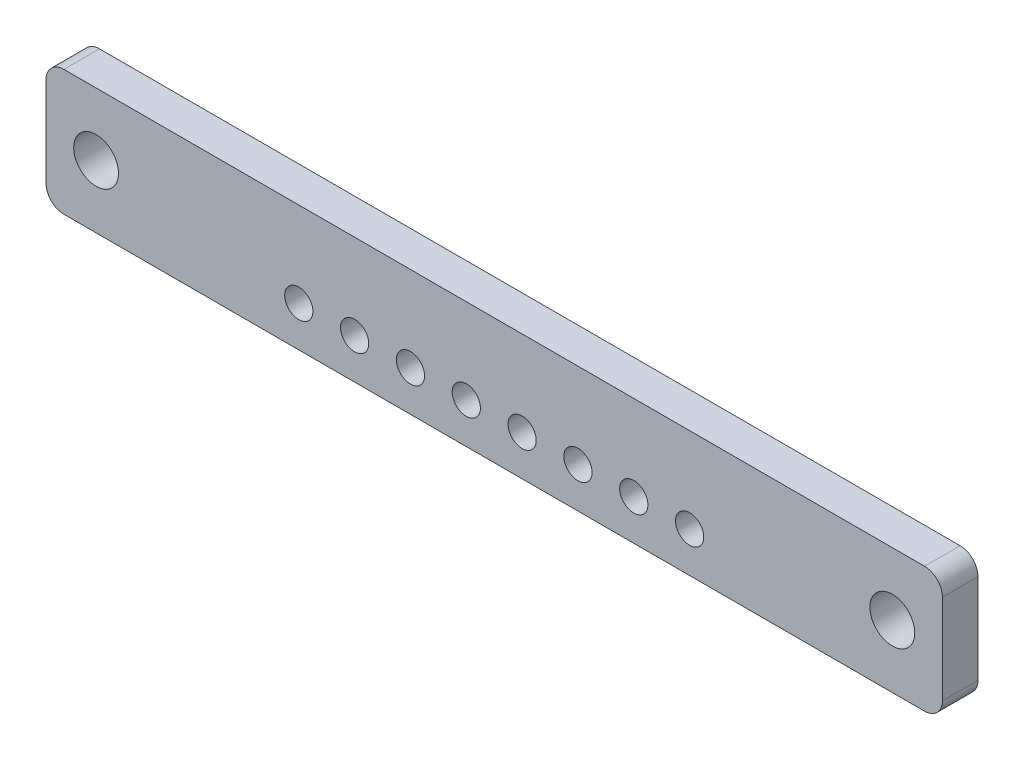
ISO-10303-21;
HEADER;
FILE_DESCRIPTION(('STEP AP214'),'2;1');
FILE_NAME('part.step','',(''),(''),'','','');
FILE_SCHEMA(('AUTOMOTIVE_DESIGN { 1 0 10303 214 1 1 1 1 }'));
ENDSEC;
DATA;
#1=APPLICATION_CONTEXT('core data for automotive mechanical design processes');
#2=APPLICATION_PROTOCOL_DEFINITION('international standard','automotive_design',2000,#1);
#3=PRODUCT_CONTEXT('',#1,'mechanical');
#4=PRODUCT('Part','Part','',(#3));
#5=PRODUCT_RELATED_PRODUCT_CATEGORY('part','',(#4));
#6=PRODUCT_DEFINITION_FORMATION('','',#4);
#7=PRODUCT_DEFINITION_CONTEXT('part definition',#1,'design');
#8=PRODUCT_DEFINITION('design','',#6,#7);
#9=PRODUCT_DEFINITION_SHAPE('','',#8);
#10=(LENGTH_UNIT() NAMED_UNIT(*) SI_UNIT(.MILLI.,.METRE.));
#11=(NAMED_UNIT(*) PLANE_ANGLE_UNIT() SI_UNIT($,.RADIAN.));
#12=(NAMED_UNIT(*) SI_UNIT($,.STERADIAN.) SOLID_ANGLE_UNIT());
#13=UNCERTAINTY_MEASURE_WITH_UNIT(LENGTH_MEASURE(1.E-05),#10,'distance_accuracy_value','');
#14=(GEOMETRIC_REPRESENTATION_CONTEXT(3) GLOBAL_UNCERTAINTY_ASSIGNED_CONTEXT((#13)) GLOBAL_UNIT_ASSIGNED_CONTEXT((#10,
#11,#12)) REPRESENTATION_CONTEXT('',''));
#15=CARTESIAN_POINT('',(0.,0.,0.));
#16=DIRECTION('',(0.,0.,1.));
#17=DIRECTION('',(1.,0.,0.));
#18=AXIS2_PLACEMENT_3D('',#15,#16,#17);
#19=CARTESIAN_POINT('',(0.,-23.495,21.7812));
#20=DIRECTION('',(0.,1.,0.));
#21=DIRECTION('',(0.,0.,1.));
#22=AXIS2_PLACEMENT_3D('',#19,#20,#21);
#23=PLANE('',#22);
#24=DIRECTION('',(-1.,0.,0.));
#25=VECTOR('',#24,1.);
#26=CARTESIAN_POINT('',(0.,-23.495,24.3012));
#27=LINE('',#26,#25);
#28=CARTESIAN_POINT('',(30.48,-23.495,24.3012));
#29=VERTEX_POINT('',#28);
#30=CARTESIAN_POINT('',(-30.48,-23.495,24.3012));
#31=VERTEX_POINT('',#30);
#32=EDGE_CURVE('E11',#29,#31,#27,.T.);
#33=ORIENTED_EDGE('',*,*,#32,.T.);
#34=DIRECTION('',(0.,0.,1.));
#35=VECTOR('',#34,1.);
#36=CARTESIAN_POINT('',(-30.48,-23.495,21.7812));
#37=LINE('',#36,#35);
#38=CARTESIAN_POINT('',(-30.48,-23.495,21.7812));
#39=VERTEX_POINT('',#38);
#40=EDGE_CURVE('E52',#39,#31,#37,.T.);
#41=ORIENTED_EDGE('',*,*,#40,.F.);
#42=DIRECTION('',(-1.,0.,0.));
#43=VECTOR('',#42,1.);
#44=CARTESIAN_POINT('',(0.,-23.495,21.7812));
#45=LINE('',#44,#43);
#46=CARTESIAN_POINT('',(30.48,-23.495,21.7812));
#47=VERTEX_POINT('',#46);
#48=EDGE_CURVE('E179',#47,#39,#45,.T.);
#49=ORIENTED_EDGE('',*,*,#48,.F.);
#50=DIRECTION('',(0.,0.,1.));
#51=VECTOR('',#50,1.);
#52=CARTESIAN_POINT('',(30.48,-23.495,21.7812));
#53=LINE('',#52,#51);
#54=EDGE_CURVE('E121',#47,#29,#53,.T.);
#55=ORIENTED_EDGE('',*,*,#54,.T.);
#56=EDGE_LOOP('',(#33,#41,#49,#55));
#57=FACE_BOUND('',#56,.T.);
#58=ADVANCED_FACE('F45',(#57),#23,.F.);
#59=CARTESIAN_POINT('',(-30.48,-22.225,21.7812));
#60=DIRECTION('',(0.,0.,1.));
#61=DIRECTION('',(1.,0.,0.));
#62=AXIS2_PLACEMENT_3D('',#59,#60,#61);
#63=CYLINDRICAL_SURFACE('',#62,1.27);
#64=CARTESIAN_POINT('',(-30.48,-22.225,24.3012));
#65=DIRECTION('',(0.,0.,-1.));
#66=DIRECTION('',(-1.,0.,0.));
#67=AXIS2_PLACEMENT_3D('',#64,#65,#66);
#68=CIRCLE('',#67,1.27);
#69=CARTESIAN_POINT('',(-31.75,-22.225,24.3012));
#70=VERTEX_POINT('',#69);
#71=EDGE_CURVE('E176',#31,#70,#68,.T.);
#72=ORIENTED_EDGE('',*,*,#71,.T.);
#73=DIRECTION('',(0.,0.,1.));
#74=VECTOR('',#73,1.);
#75=CARTESIAN_POINT('',(-31.75,-22.225,21.7812));
#76=LINE('',#75,#74);
#77=CARTESIAN_POINT('',(-31.75,-22.225,21.7812));
#78=VERTEX_POINT('',#77);
#79=EDGE_CURVE('E173',#78,#70,#76,.T.);
#80=ORIENTED_EDGE('',*,*,#79,.F.);
#81=CARTESIAN_POINT('',(-30.48,-22.225,21.7812));
#82=DIRECTION('',(0.,0.,-1.));
#83=DIRECTION('',(-1.,0.,0.));
#84=AXIS2_PLACEMENT_3D('',#81,#82,#83);
#85=CIRCLE('',#84,1.27);
#86=EDGE_CURVE('E170',#39,#78,#85,.T.);
#87=ORIENTED_EDGE('',*,*,#86,.F.);
#88=ORIENTED_EDGE('',*,*,#40,.T.);
#89=EDGE_LOOP('',(#72,#80,#87,#88));
#90=FACE_BOUND('',#89,.T.);
#91=ADVANCED_FACE('F182',(#90),#63,.T.);
#92=CARTESIAN_POINT('',(-31.75,-19.05,21.7812));
#93=DIRECTION('',(1.,0.,0.));
#94=DIRECTION('',(0.,0.,-1.));
#95=AXIS2_PLACEMENT_3D('',#92,#93,#94);
#96=PLANE('',#95);
#97=DIRECTION('',(0.,1.,0.));
#98=VECTOR('',#97,1.);
#99=CARTESIAN_POINT('',(-31.75,-19.05,24.3012));
#100=LINE('',#99,#98);
#101=CARTESIAN_POINT('',(-31.75,-15.875,24.3012));
#102=VERTEX_POINT('',#101);
#103=EDGE_CURVE('E168',#70,#102,#100,.T.);
#104=ORIENTED_EDGE('',*,*,#103,.T.);
#105=DIRECTION('',(0.,0.,1.));
#106=VECTOR('',#105,1.);
#107=CARTESIAN_POINT('',(-31.75,-15.875,21.7812));
#108=LINE('',#107,#106);
#109=CARTESIAN_POINT('',(-31.75,-15.875,21.7812));
#110=VERTEX_POINT('',#109);
#111=EDGE_CURVE('E165',#110,#102,#108,.T.);
#112=ORIENTED_EDGE('',*,*,#111,.F.);
#113=DIRECTION('',(0.,1.,0.));
#114=VECTOR('',#113,1.);
#115=CARTESIAN_POINT('',(-31.75,-19.05,21.7812));
#116=LINE('',#115,#114);
#117=EDGE_CURVE('E162',#78,#110,#116,.T.);
#118=ORIENTED_EDGE('',*,*,#117,.F.);
#119=ORIENTED_EDGE('',*,*,#79,.T.);
#120=EDGE_LOOP('',(#104,#112,#118,#119));
#121=FACE_BOUND('',#120,.T.);
#122=ADVANCED_FACE('F189',(#121),#96,.F.);
#123=CARTESIAN_POINT('',(-30.48,-15.875,21.7812));
#124=DIRECTION('',(0.,0.,1.));
#125=DIRECTION('',(1.,0.,0.));
#126=AXIS2_PLACEMENT_3D('',#123,#124,#125);
#127=CYLINDRICAL_SURFACE('',#126,1.27);
#128=CARTESIAN_POINT('',(-30.48,-15.875,24.3012));
#129=DIRECTION('',(0.,0.,1.));
#130=DIRECTION('',(1.,0.,0.));
#131=AXIS2_PLACEMENT_3D('',#128,#129,#130);
#132=CIRCLE('',#131,1.27);
#133=CARTESIAN_POINT('',(-30.48,-14.605,24.3012));
#134=VERTEX_POINT('',#133);
#135=EDGE_CURVE('E160',#102,#134,#132,.F.);
#136=ORIENTED_EDGE('',*,*,#135,.T.);
#137=DIRECTION('',(0.,0.,1.));
#138=VECTOR('',#137,1.);
#139=CARTESIAN_POINT('',(-30.48,-14.605,21.7812));
#140=LINE('',#139,#138);
#141=CARTESIAN_POINT('',(-30.48,-14.605,21.7812));
#142=VERTEX_POINT('',#141);
#143=EDGE_CURVE('E157',#142,#134,#140,.T.);
#144=ORIENTED_EDGE('',*,*,#143,.F.);
#145=CARTESIAN_POINT('',(-30.48,-15.875,21.7812));
#146=DIRECTION('',(0.,0.,1.));
#147=DIRECTION('',(1.,0.,0.));
#148=AXIS2_PLACEMENT_3D('',#145,#146,#147);
#149=CIRCLE('',#148,1.27);
#150=EDGE_CURVE('E154',#110,#142,#149,.F.);
#151=ORIENTED_EDGE('',*,*,#150,.F.);
#152=ORIENTED_EDGE('',*,*,#111,.T.);
#153=EDGE_LOOP('',(#136,#144,#151,#152));
#154=FACE_BOUND('',#153,.T.);
#155=ADVANCED_FACE('F193',(#154),#127,.T.);
#156=CARTESIAN_POINT('',(0.,-14.605,21.7812));
#157=DIRECTION('',(0.,1.,0.));
#158=DIRECTION('',(0.,0.,1.));
#159=AXIS2_PLACEMENT_3D('',#156,#157,#158);
#160=PLANE('',#159);
#161=DIRECTION('',(-1.,0.,0.));
#162=VECTOR('',#161,1.);
#163=CARTESIAN_POINT('',(0.,-14.605,24.3012));
#164=LINE('',#163,#162);
#165=CARTESIAN_POINT('',(30.48,-14.605,24.3012));
#166=VERTEX_POINT('',#165);
#167=EDGE_CURVE('E151',#166,#134,#164,.T.);
#168=ORIENTED_EDGE('',*,*,#167,.F.);
#169=DIRECTION('',(0.,0.,1.));
#170=VECTOR('',#169,1.);
#171=CARTESIAN_POINT('',(30.48,-14.605,21.7812));
#172=LINE('',#171,#170);
#173=CARTESIAN_POINT('',(30.48,-14.605,21.7812));
#174=VERTEX_POINT('',#173);
#175=EDGE_CURVE('E148',#174,#166,#172,.T.);
#176=ORIENTED_EDGE('',*,*,#175,.F.);
#177=DIRECTION('',(-1.,0.,0.));
#178=VECTOR('',#177,1.);
#179=CARTESIAN_POINT('',(0.,-14.605,21.7812));
#180=LINE('',#179,#178);
#181=EDGE_CURVE('E145',#174,#142,#180,.T.);
#182=ORIENTED_EDGE('',*,*,#181,.T.);
#183=ORIENTED_EDGE('',*,*,#143,.T.);
#184=EDGE_LOOP('',(#168,#176,#182,#183));
#185=FACE_BOUND('',#184,.T.);
#186=ADVANCED_FACE('F274',(#185),#160,.T.);
#187=CARTESIAN_POINT('',(30.48,-15.875,21.7812));
#188=DIRECTION('',(0.,0.,1.));
#189=DIRECTION('',(1.,0.,0.));
#190=AXIS2_PLACEMENT_3D('',#187,#188,#189);
#191=CYLINDRICAL_SURFACE('',#190,1.27);
#192=CARTESIAN_POINT('',(30.48,-15.875,24.3012));
#193=DIRECTION('',(0.,0.,1.));
#194=DIRECTION('',(1.,0.,0.));
#195=AXIS2_PLACEMENT_3D('',#192,#193,#194);
#196=CIRCLE('',#195,1.27);
#197=CARTESIAN_POINT('',(31.75,-15.875,24.3012));
#198=VERTEX_POINT('',#197);
#199=EDGE_CURVE('E143',#166,#198,#196,.F.);
#200=ORIENTED_EDGE('',*,*,#199,.T.);
#201=DIRECTION('',(0.,0.,1.));
#202=VECTOR('',#201,1.);
#203=CARTESIAN_POINT('',(31.75,-15.875,21.7812));
#204=LINE('',#203,#202);
#205=CARTESIAN_POINT('',(31.75,-15.875,21.7812));
#206=VERTEX_POINT('',#205);
#207=EDGE_CURVE('E141',#206,#198,#204,.T.);
#208=ORIENTED_EDGE('',*,*,#207,.F.);
#209=CARTESIAN_POINT('',(30.48,-15.875,21.7812));
#210=DIRECTION('',(0.,0.,1.));
#211=DIRECTION('',(1.,0.,0.));
#212=AXIS2_PLACEMENT_3D('',#209,#210,#211);
#213=CIRCLE('',#212,1.27);
#214=EDGE_CURVE('E131',#174,#206,#213,.F.);
#215=ORIENTED_EDGE('',*,*,#214,.F.);
#216=ORIENTED_EDGE('',*,*,#175,.T.);
#217=EDGE_LOOP('',(#200,#208,#215,#216));
#218=FACE_BOUND('',#217,.T.);
#219=ADVANCED_FACE('F261',(#218),#191,.T.);
#220=CARTESIAN_POINT('',(31.75,-19.05,21.7812));
#221=DIRECTION('',(1.,0.,0.));
#222=DIRECTION('',(0.,0.,-1.));
#223=AXIS2_PLACEMENT_3D('',#220,#221,#222);
#224=PLANE('',#223);
#225=DIRECTION('',(0.,1.,0.));
#226=VECTOR('',#225,1.);
#227=CARTESIAN_POINT('',(31.75,-19.05,24.3012));
#228=LINE('',#227,#226);
#229=CARTESIAN_POINT('',(31.75,-22.225,24.3012));
#230=VERTEX_POINT('',#229);
#231=EDGE_CURVE('E112',#230,#198,#228,.T.);
#232=ORIENTED_EDGE('',*,*,#231,.F.);
#233=DIRECTION('',(0.,0.,1.));
#234=VECTOR('',#233,1.);
#235=CARTESIAN_POINT('',(31.75,-22.225,21.7812));
#236=LINE('',#235,#234);
#237=CARTESIAN_POINT('',(31.75,-22.225,21.7812));
#238=VERTEX_POINT('',#237);
#239=EDGE_CURVE('E104',#238,#230,#236,.T.);
#240=ORIENTED_EDGE('',*,*,#239,.F.);
#241=DIRECTION('',(0.,1.,0.));
#242=VECTOR('',#241,1.);
#243=CARTESIAN_POINT('',(31.75,-19.05,21.7812));
#244=LINE('',#243,#242);
#245=EDGE_CURVE('E109',#238,#206,#244,.T.);
#246=ORIENTED_EDGE('',*,*,#245,.T.);
#247=ORIENTED_EDGE('',*,*,#207,.T.);
#248=EDGE_LOOP('',(#232,#240,#246,#247));
#249=FACE_BOUND('',#248,.T.);
#250=ADVANCED_FACE('F106',(#249),#224,.T.);
#251=CARTESIAN_POINT('',(9.88785714285713,-20.6375,21.7812));
#252=DIRECTION('',(0.,0.,1.));
#253=DIRECTION('',(1.,0.,0.));
#254=AXIS2_PLACEMENT_3D('',#251,#252,#253);
#255=CYLINDRICAL_SURFACE('',#254,1.);
#256=CARTESIAN_POINT('',(9.88785714285713,-20.6375,21.7812));
#257=DIRECTION('',(0.,0.,-1.));
#258=DIRECTION('',(-1.,0.,0.));
#259=AXIS2_PLACEMENT_3D('',#256,#257,#258);
#260=CIRCLE('',#259,1.);
#261=CARTESIAN_POINT('',(8.88785714285713,-20.6375,21.7812));
#262=VERTEX_POINT('',#261);
#263=EDGE_CURVE('E132',#262,#262,#260,.T.);
#264=ORIENTED_EDGE('',*,*,#263,.T.);
#265=EDGE_LOOP('',(#264));
#266=FACE_BOUND('',#265,.T.);
#267=CARTESIAN_POINT('',(9.88785714285713,-20.6375,24.3012));
#268=DIRECTION('',(0.,0.,-1.));
#269=DIRECTION('',(-1.,0.,0.));
#270=AXIS2_PLACEMENT_3D('',#267,#268,#269);
#271=CIRCLE('',#270,1.);
#272=CARTESIAN_POINT('',(8.88785714285713,-20.6375,24.3012));
#273=VERTEX_POINT('',#272);
#274=EDGE_CURVE('E135',#273,#273,#271,.T.);
#275=ORIENTED_EDGE('',*,*,#274,.F.);
#276=EDGE_LOOP('',(#275));
#277=FACE_BOUND('',#276,.T.);
#278=ADVANCED_FACE('F249',(#266,#277),#255,.F.);
#279=CARTESIAN_POINT('',(5.93271428571428,-20.6375,21.7812));
#280=DIRECTION('',(0.,0.,1.));
#281=DIRECTION('',(1.,0.,0.));
#282=AXIS2_PLACEMENT_3D('',#279,#280,#281);
#283=CYLINDRICAL_SURFACE('',#282,1.);
#284=CARTESIAN_POINT('',(5.93271428571428,-20.6375,21.7812));
#285=DIRECTION('',(0.,0.,-1.));
#286=DIRECTION('',(-1.,0.,0.));
#287=AXIS2_PLACEMENT_3D('',#284,#285,#286);
#288=CIRCLE('',#287,1.);
#289=CARTESIAN_POINT('',(4.93271428571428,-20.6375,21.7812));
#290=VERTEX_POINT('',#289);
#291=EDGE_CURVE('E242',#290,#290,#288,.T.);
#292=ORIENTED_EDGE('',*,*,#291,.T.);
#293=EDGE_LOOP('',(#292));
#294=FACE_BOUND('',#293,.T.);
#295=CARTESIAN_POINT('',(5.93271428571428,-20.6375,24.3012));
#296=DIRECTION('',(0.,0.,-1.));
#297=DIRECTION('',(-1.,0.,0.));
#298=AXIS2_PLACEMENT_3D('',#295,#296,#297);
#299=CIRCLE('',#298,1.);
#300=CARTESIAN_POINT('',(4.93271428571428,-20.6375,24.3012));
#301=VERTEX_POINT('',#300);
#302=EDGE_CURVE('E239',#301,#301,#299,.T.);
#303=ORIENTED_EDGE('',*,*,#302,.F.);
#304=EDGE_LOOP('',(#303));
#305=FACE_BOUND('',#304,.T.);
#306=ADVANCED_FACE('F251',(#294,#305),#283,.F.);
#307=CARTESIAN_POINT('',(1.97757142857142,-20.6375,21.7812));
#308=DIRECTION('',(0.,0.,1.));
#309=DIRECTION('',(1.,0.,0.));
#310=AXIS2_PLACEMENT_3D('',#307,#308,#309);
#311=CYLINDRICAL_SURFACE('',#310,1.);
#312=CARTESIAN_POINT('',(1.97757142857142,-20.6375,21.7812));
#313=DIRECTION('',(0.,0.,-1.));
#314=DIRECTION('',(-1.,0.,0.));
#315=AXIS2_PLACEMENT_3D('',#312,#313,#314);
#316=CIRCLE('',#315,1.);
#317=CARTESIAN_POINT('',(0.97757142857142,-20.6375,21.7812));
#318=VERTEX_POINT('',#317);
#319=EDGE_CURVE('E236',#318,#318,#316,.T.);
#320=ORIENTED_EDGE('',*,*,#319,.T.);
#321=EDGE_LOOP('',(#320));
#322=FACE_BOUND('',#321,.T.);
#323=CARTESIAN_POINT('',(1.97757142857142,-20.6375,24.3012));
#324=DIRECTION('',(0.,0.,-1.));
#325=DIRECTION('',(-1.,0.,0.));
#326=AXIS2_PLACEMENT_3D('',#323,#324,#325);
#327=CIRCLE('',#326,1.);
#328=CARTESIAN_POINT('',(0.97757142857142,-20.6375,24.3012));
#329=VERTEX_POINT('',#328);
#330=EDGE_CURVE('E233',#329,#329,#327,.T.);
#331=ORIENTED_EDGE('',*,*,#330,.F.);
#332=EDGE_LOOP('',(#331));
#333=FACE_BOUND('',#332,.T.);
#334=ADVANCED_FACE('F258',(#322,#333),#311,.F.);
#335=CARTESIAN_POINT('',(-1.97757142857143,-20.6375,21.7812));
#336=DIRECTION('',(0.,0.,1.));
#337=DIRECTION('',(1.,0.,0.));
#338=AXIS2_PLACEMENT_3D('',#335,#336,#337);
#339=CYLINDRICAL_SURFACE('',#338,1.);
#340=CARTESIAN_POINT('',(-1.97757142857143,-20.6375,21.7812));
#341=DIRECTION('',(0.,0.,-1.));
#342=DIRECTION('',(-1.,0.,0.));
#343=AXIS2_PLACEMENT_3D('',#340,#341,#342);
#344=CIRCLE('',#343,1.);
#345=CARTESIAN_POINT('',(-2.97757142857143,-20.6375,21.7812));
#346=VERTEX_POINT('',#345);
#347=EDGE_CURVE('E230',#346,#346,#344,.T.);
#348=ORIENTED_EDGE('',*,*,#347,.T.);
#349=EDGE_LOOP('',(#348));
#350=FACE_BOUND('',#349,.T.);
#351=CARTESIAN_POINT('',(-1.97757142857143,-20.6375,24.3012));
#352=DIRECTION('',(0.,0.,-1.));
#353=DIRECTION('',(-1.,0.,0.));
#354=AXIS2_PLACEMENT_3D('',#351,#352,#353);
#355=CIRCLE('',#354,1.);
#356=CARTESIAN_POINT('',(-2.97757142857143,-20.6375,24.3012));
#357=VERTEX_POINT('',#356);
#358=EDGE_CURVE('E227',#357,#357,#355,.T.);
#359=ORIENTED_EDGE('',*,*,#358,.F.);
#360=EDGE_LOOP('',(#359));
#361=FACE_BOUND('',#360,.T.);
#362=ADVANCED_FACE('F313',(#350,#361),#339,.F.);
#363=CARTESIAN_POINT('',(-5.9327142857143,-20.6375,21.7812));
#364=DIRECTION('',(0.,0.,1.));
#365=DIRECTION('',(1.,0.,0.));
#366=AXIS2_PLACEMENT_3D('',#363,#364,#365);
#367=CYLINDRICAL_SURFACE('',#366,1.);
#368=CARTESIAN_POINT('',(-5.9327142857143,-20.6375,21.7812));
#369=DIRECTION('',(0.,0.,-1.));
#370=DIRECTION('',(-1.,0.,0.));
#371=AXIS2_PLACEMENT_3D('',#368,#369,#370);
#372=CIRCLE('',#371,1.);
#373=CARTESIAN_POINT('',(-6.9327142857143,-20.6375,21.7812));
#374=VERTEX_POINT('',#373);
#375=EDGE_CURVE('E224',#374,#374,#372,.T.);
#376=ORIENTED_EDGE('',*,*,#375,.T.);
#377=EDGE_LOOP('',(#376));
#378=FACE_BOUND('',#377,.T.);
#379=CARTESIAN_POINT('',(-5.9327142857143,-20.6375,24.3012));
#380=DIRECTION('',(0.,0.,-1.));
#381=DIRECTION('',(-1.,0.,0.));
#382=AXIS2_PLACEMENT_3D('',#379,#380,#381);
#383=CIRCLE('',#382,1.);
#384=CARTESIAN_POINT('',(-6.9327142857143,-20.6375,24.3012));
#385=VERTEX_POINT('',#384);
#386=EDGE_CURVE('E221',#385,#385,#383,.T.);
#387=ORIENTED_EDGE('',*,*,#386,.F.);
#388=EDGE_LOOP('',(#387));
#389=FACE_BOUND('',#388,.T.);
#390=ADVANCED_FACE('F324',(#378,#389),#367,.F.);
#391=CARTESIAN_POINT('',(-9.88785714285715,-20.6375,21.7812));
#392=DIRECTION('',(0.,0.,1.));
#393=DIRECTION('',(1.,0.,0.));
#394=AXIS2_PLACEMENT_3D('',#391,#392,#393);
#395=CYLINDRICAL_SURFACE('',#394,1.);
#396=CARTESIAN_POINT('',(-9.88785714285715,-20.6375,21.7812));
#397=DIRECTION('',(0.,0.,-1.));
#398=DIRECTION('',(-1.,0.,0.));
#399=AXIS2_PLACEMENT_3D('',#396,#397,#398);
#400=CIRCLE('',#399,1.);
#401=CARTESIAN_POINT('',(-10.8878571428572,-20.6375,21.7812));
#402=VERTEX_POINT('',#401);
#403=EDGE_CURVE('E218',#402,#402,#400,.T.);
#404=ORIENTED_EDGE('',*,*,#403,.T.);
#405=EDGE_LOOP('',(#404));
#406=FACE_BOUND('',#405,.T.);
#407=CARTESIAN_POINT('',(-9.88785714285715,-20.6375,24.3012));
#408=DIRECTION('',(0.,0.,-1.));
#409=DIRECTION('',(-1.,0.,0.));
#410=AXIS2_PLACEMENT_3D('',#407,#408,#409);
#411=CIRCLE('',#410,1.);
#412=CARTESIAN_POINT('',(-10.8878571428572,-20.6375,24.3012));
#413=VERTEX_POINT('',#412);
#414=EDGE_CURVE('E215',#413,#413,#411,.T.);
#415=ORIENTED_EDGE('',*,*,#414,.F.);
#416=EDGE_LOOP('',(#415));
#417=FACE_BOUND('',#416,.T.);
#418=ADVANCED_FACE('F335',(#406,#417),#395,.F.);
#419=CARTESIAN_POINT('',(-13.843,-20.6375,21.7812));
#420=DIRECTION('',(0.,0.,1.));
#421=DIRECTION('',(1.,0.,0.));
#422=AXIS2_PLACEMENT_3D('',#419,#420,#421);
#423=CYLINDRICAL_SURFACE('',#422,1.);
#424=CARTESIAN_POINT('',(-13.843,-20.6375,21.7812));
#425=DIRECTION('',(0.,0.,-1.));
#426=DIRECTION('',(-1.,0.,0.));
#427=AXIS2_PLACEMENT_3D('',#424,#425,#426);
#428=CIRCLE('',#427,1.);
#429=CARTESIAN_POINT('',(-14.843,-20.6375,21.7812));
#430=VERTEX_POINT('',#429);
#431=EDGE_CURVE('E212',#430,#430,#428,.T.);
#432=ORIENTED_EDGE('',*,*,#431,.T.);
#433=EDGE_LOOP('',(#432));
#434=FACE_BOUND('',#433,.T.);
#435=CARTESIAN_POINT('',(-13.843,-20.6375,24.3012));
#436=DIRECTION('',(0.,0.,-1.));
#437=DIRECTION('',(-1.,0.,0.));
#438=AXIS2_PLACEMENT_3D('',#435,#436,#437);
#439=CIRCLE('',#438,1.);
#440=CARTESIAN_POINT('',(-14.843,-20.6375,24.3012));
#441=VERTEX_POINT('',#440);
#442=EDGE_CURVE('E209',#441,#441,#439,.T.);
#443=ORIENTED_EDGE('',*,*,#442,.F.);
#444=EDGE_LOOP('',(#443));
#445=FACE_BOUND('',#444,.T.);
#446=ADVANCED_FACE('F346',(#434,#445),#423,.F.);
#447=CARTESIAN_POINT('',(-28.2004113120917,-19.05,21.7812));
#448=DIRECTION('',(0.,0.,1.));
#449=DIRECTION('',(1.,0.,0.));
#450=AXIS2_PLACEMENT_3D('',#447,#448,#449);
#451=CYLINDRICAL_SURFACE('',#450,1.5875);
#452=CARTESIAN_POINT('',(-28.2004113120917,-19.05,21.7812));
#453=DIRECTION('',(0.,0.,-1.));
#454=DIRECTION('',(-1.,0.,0.));
#455=AXIS2_PLACEMENT_3D('',#452,#453,#454);
#456=CIRCLE('',#455,1.5875);
#457=CARTESIAN_POINT('',(-29.7879113120917,-19.05,21.7812));
#458=VERTEX_POINT('',#457);
#459=EDGE_CURVE('E206',#458,#458,#456,.T.);
#460=ORIENTED_EDGE('',*,*,#459,.T.);
#461=EDGE_LOOP('',(#460));
#462=FACE_BOUND('',#461,.T.);
#463=CARTESIAN_POINT('',(-28.2004113120917,-19.05,24.3012));
#464=DIRECTION('',(0.,0.,-1.));
#465=DIRECTION('',(-1.,0.,0.));
#466=AXIS2_PLACEMENT_3D('',#463,#464,#465);
#467=CIRCLE('',#466,1.5875);
#468=CARTESIAN_POINT('',(-29.7879113120917,-19.05,24.3012));
#469=VERTEX_POINT('',#468);
#470=EDGE_CURVE('E203',#469,#469,#467,.T.);
#471=ORIENTED_EDGE('',*,*,#470,.F.);
#472=EDGE_LOOP('',(#471));
#473=FACE_BOUND('',#472,.T.);
#474=ADVANCED_FACE('F357',(#462,#473),#451,.F.);
#475=CARTESIAN_POINT('',(28.2004113120917,-19.05,21.7812));
#476=DIRECTION('',(0.,0.,1.));
#477=DIRECTION('',(1.,0.,0.));
#478=AXIS2_PLACEMENT_3D('',#475,#476,#477);
#479=CYLINDRICAL_SURFACE('',#478,1.5875);
#480=CARTESIAN_POINT('',(28.2004113120917,-19.05,21.7812));
#481=DIRECTION('',(0.,0.,1.));
#482=DIRECTION('',(-1.,0.,0.));
#483=AXIS2_PLACEMENT_3D('',#480,#481,#482);
#484=CIRCLE('',#483,1.5875);
#485=CARTESIAN_POINT('',(26.6129113120918,-19.05,21.7812));
#486=VERTEX_POINT('',#485);
#487=EDGE_CURVE('E197',#486,#486,#484,.T.);
#488=ORIENTED_EDGE('',*,*,#487,.F.);
#489=EDGE_LOOP('',(#488));
#490=FACE_BOUND('',#489,.T.);
#491=CARTESIAN_POINT('',(28.2004113120917,-19.05,24.3012));
#492=DIRECTION('',(0.,0.,1.));
#493=DIRECTION('',(-1.,0.,0.));
#494=AXIS2_PLACEMENT_3D('',#491,#492,#493);
#495=CIRCLE('',#494,1.5875);
#496=CARTESIAN_POINT('',(26.6129113120918,-19.05,24.3012));
#497=VERTEX_POINT('',#496);
#498=EDGE_CURVE('E194',#497,#497,#495,.T.);
#499=ORIENTED_EDGE('',*,*,#498,.T.);
#500=EDGE_LOOP('',(#499));
#501=FACE_BOUND('',#500,.T.);
#502=ADVANCED_FACE('F368',(#490,#501),#479,.F.);
#503=CARTESIAN_POINT('',(30.48,-22.225,21.7812));
#504=DIRECTION('',(0.,0.,1.));
#505=DIRECTION('',(1.,0.,0.));
#506=AXIS2_PLACEMENT_3D('',#503,#504,#505);
#507=CYLINDRICAL_SURFACE('',#506,1.27);
#508=CARTESIAN_POINT('',(30.48,-22.225,24.3012));
#509=DIRECTION('',(0.,0.,-1.));
#510=DIRECTION('',(-1.,0.,0.));
#511=AXIS2_PLACEMENT_3D('',#508,#509,#510);
#512=CIRCLE('',#511,1.27);
#513=EDGE_CURVE('E124',#230,#29,#512,.T.);
#514=ORIENTED_EDGE('',*,*,#513,.T.);
#515=ORIENTED_EDGE('',*,*,#54,.F.);
#516=CARTESIAN_POINT('',(30.48,-22.225,21.7812));
#517=DIRECTION('',(0.,0.,-1.));
#518=DIRECTION('',(-1.,0.,0.));
#519=AXIS2_PLACEMENT_3D('',#516,#517,#518);
#520=CIRCLE('',#519,1.27);
#521=EDGE_CURVE('E119',#238,#47,#520,.T.);
#522=ORIENTED_EDGE('',*,*,#521,.F.);
#523=ORIENTED_EDGE('',*,*,#239,.T.);
#524=EDGE_LOOP('',(#514,#515,#522,#523));
#525=FACE_BOUND('',#524,.T.);
#526=ADVANCED_FACE('F120',(#525),#507,.T.);
#527=CARTESIAN_POINT('',(13.843,-20.6375,21.7812));
#528=DIRECTION('',(0.,0.,1.));
#529=DIRECTION('',(1.,0.,0.));
#530=AXIS2_PLACEMENT_3D('',#527,#528,#529);
#531=CYLINDRICAL_SURFACE('',#530,1.);
#532=CARTESIAN_POINT('',(13.843,-20.6375,21.7812));
#533=DIRECTION('',(0.,0.,-1.));
#534=DIRECTION('',(-1.,0.,0.));
#535=AXIS2_PLACEMENT_3D('',#532,#533,#534);
#536=CIRCLE('',#535,1.);
#537=CARTESIAN_POINT('',(12.843,-20.6375,21.7812));
#538=VERTEX_POINT('',#537);
#539=EDGE_CURVE('E125',#538,#538,#536,.T.);
#540=ORIENTED_EDGE('',*,*,#539,.T.);
#541=EDGE_LOOP('',(#540));
#542=FACE_BOUND('',#541,.T.);
#543=CARTESIAN_POINT('',(13.843,-20.6375,24.3012));
#544=DIRECTION('',(0.,0.,-1.));
#545=DIRECTION('',(-1.,0.,0.));
#546=AXIS2_PLACEMENT_3D('',#543,#544,#545);
#547=CIRCLE('',#546,1.);
#548=CARTESIAN_POINT('',(12.843,-20.6375,24.3012));
#549=VERTEX_POINT('',#548);
#550=EDGE_CURVE('E477',#549,#549,#547,.T.);
#551=ORIENTED_EDGE('',*,*,#550,.F.);
#552=EDGE_LOOP('',(#551));
#553=FACE_BOUND('',#552,.T.);
#554=ADVANCED_FACE('F389',(#542,#553),#531,.F.);
#555=CARTESIAN_POINT('',(0.,-19.05,21.7812));
#556=DIRECTION('',(0.,0.,-1.));
#557=DIRECTION('',(1.,0.,0.));
#558=AXIS2_PLACEMENT_3D('',#555,#556,#557);
#559=PLANE('',#558);
#560=ORIENTED_EDGE('',*,*,#48,.T.);
#561=ORIENTED_EDGE('',*,*,#86,.T.);
#562=ORIENTED_EDGE('',*,*,#117,.T.);
#563=ORIENTED_EDGE('',*,*,#150,.T.);
#564=ORIENTED_EDGE('',*,*,#181,.F.);
#565=ORIENTED_EDGE('',*,*,#214,.T.);
#566=ORIENTED_EDGE('',*,*,#245,.F.);
#567=ORIENTED_EDGE('',*,*,#521,.T.);
#568=EDGE_LOOP('',(#560,#561,#562,#563,#564,#565,#566,#567));
#569=FACE_BOUND('',#568,.T.);
#570=ORIENTED_EDGE('',*,*,#487,.T.);
#571=EDGE_LOOP('',(#570));
#572=FACE_BOUND('',#571,.T.);
#573=ORIENTED_EDGE('',*,*,#459,.F.);
#574=EDGE_LOOP('',(#573));
#575=FACE_BOUND('',#574,.T.);
#576=ORIENTED_EDGE('',*,*,#431,.F.);
#577=EDGE_LOOP('',(#576));
#578=FACE_BOUND('',#577,.T.);
#579=ORIENTED_EDGE('',*,*,#403,.F.);
#580=EDGE_LOOP('',(#579));
#581=FACE_BOUND('',#580,.T.);
#582=ORIENTED_EDGE('',*,*,#375,.F.);
#583=EDGE_LOOP('',(#582));
#584=FACE_BOUND('',#583,.T.);
#585=ORIENTED_EDGE('',*,*,#347,.F.);
#586=EDGE_LOOP('',(#585));
#587=FACE_BOUND('',#586,.T.);
#588=ORIENTED_EDGE('',*,*,#319,.F.);
#589=EDGE_LOOP('',(#588));
#590=FACE_BOUND('',#589,.T.);
#591=ORIENTED_EDGE('',*,*,#291,.F.);
#592=EDGE_LOOP('',(#591));
#593=FACE_BOUND('',#592,.T.);
#594=ORIENTED_EDGE('',*,*,#263,.F.);
#595=EDGE_LOOP('',(#594));
#596=FACE_BOUND('',#595,.T.);
#597=ORIENTED_EDGE('',*,*,#539,.F.);
#598=EDGE_LOOP('',(#597));
#599=FACE_BOUND('',#598,.T.);
#600=ADVANCED_FACE('F127',(#569,#572,#575,#578,#581,#584,#587,#590,#593,#596,#599),#559,.T.);
#601=CARTESIAN_POINT('',(0.,-19.05,24.3012));
#602=DIRECTION('',(0.,0.,-1.));
#603=DIRECTION('',(1.,0.,0.));
#604=AXIS2_PLACEMENT_3D('',#601,#602,#603);
#605=PLANE('',#604);
#606=ORIENTED_EDGE('',*,*,#32,.F.);
#607=ORIENTED_EDGE('',*,*,#513,.F.);
#608=ORIENTED_EDGE('',*,*,#231,.T.);
#609=ORIENTED_EDGE('',*,*,#199,.F.);
#610=ORIENTED_EDGE('',*,*,#167,.T.);
#611=ORIENTED_EDGE('',*,*,#135,.F.);
#612=ORIENTED_EDGE('',*,*,#103,.F.);
#613=ORIENTED_EDGE('',*,*,#71,.F.);
#614=EDGE_LOOP('',(#606,#607,#608,#609,#610,#611,#612,#613));
#615=FACE_BOUND('',#614,.T.);
#616=ORIENTED_EDGE('',*,*,#498,.F.);
#617=EDGE_LOOP('',(#616));
#618=FACE_BOUND('',#617,.T.);
#619=ORIENTED_EDGE('',*,*,#470,.T.);
#620=EDGE_LOOP('',(#619));
#621=FACE_BOUND('',#620,.T.);
#622=ORIENTED_EDGE('',*,*,#442,.T.);
#623=EDGE_LOOP('',(#622));
#624=FACE_BOUND('',#623,.T.);
#625=ORIENTED_EDGE('',*,*,#414,.T.);
#626=EDGE_LOOP('',(#625));
#627=FACE_BOUND('',#626,.T.);
#628=ORIENTED_EDGE('',*,*,#386,.T.);
#629=EDGE_LOOP('',(#628));
#630=FACE_BOUND('',#629,.T.);
#631=ORIENTED_EDGE('',*,*,#358,.T.);
#632=EDGE_LOOP('',(#631));
#633=FACE_BOUND('',#632,.T.);
#634=ORIENTED_EDGE('',*,*,#330,.T.);
#635=EDGE_LOOP('',(#634));
#636=FACE_BOUND('',#635,.T.);
#637=ORIENTED_EDGE('',*,*,#302,.T.);
#638=EDGE_LOOP('',(#637));
#639=FACE_BOUND('',#638,.T.);
#640=ORIENTED_EDGE('',*,*,#274,.T.);
#641=EDGE_LOOP('',(#640));
#642=FACE_BOUND('',#641,.T.);
#643=ORIENTED_EDGE('',*,*,#550,.T.);
#644=EDGE_LOOP('',(#643));
#645=FACE_BOUND('',#644,.T.);
#646=ADVANCED_FACE('F185',(#615,#618,#621,#624,#627,#630,#633,#636,#639,#642,#645),#605,.F.);
#647=CLOSED_SHELL('',(#58,#91,#122,#155,#186,#219,#250,#278,#306,#334,#362,#390,#418,#446,#474,
#502,#526,#554,#600,#646));
#648=MANIFOLD_SOLID_BREP('B2',#647);
#649=ADVANCED_BREP_SHAPE_REPRESENTATION('',(#18,#648),#14);
#650=SHAPE_DEFINITION_REPRESENTATION(#9,#649);
ENDSEC;
END-ISO-10303-21;
